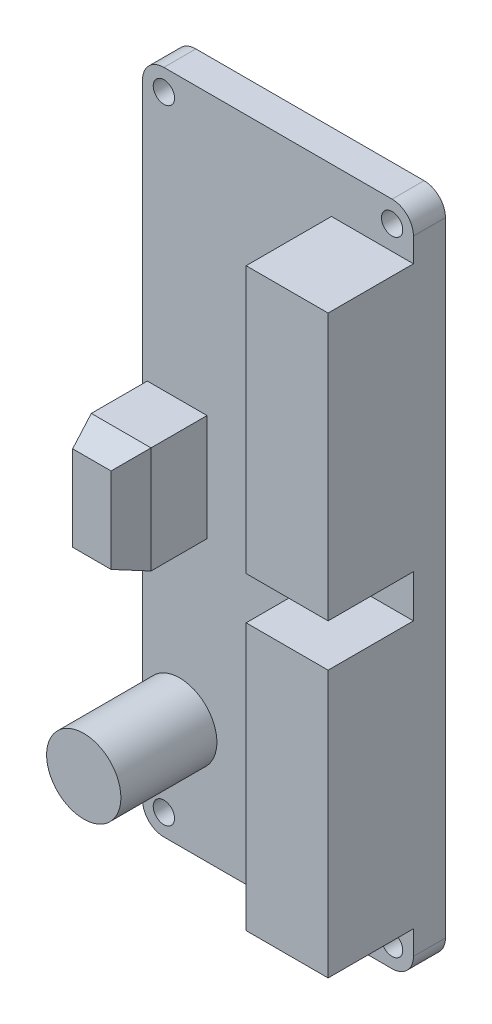
ISO-10303-21;
HEADER;
FILE_DESCRIPTION(('STEP AP214'),'2;1');
FILE_NAME('part.step','',(''),(''),'','','');
FILE_SCHEMA(('AUTOMOTIVE_DESIGN { 1 0 10303 214 1 1 1 1 }'));
ENDSEC;
DATA;
#1=APPLICATION_CONTEXT('core data for automotive mechanical design processes');
#2=APPLICATION_PROTOCOL_DEFINITION('international standard','automotive_design',2000,#1);
#3=PRODUCT_CONTEXT('',#1,'mechanical');
#4=PRODUCT('Part','Part','',(#3));
#5=PRODUCT_RELATED_PRODUCT_CATEGORY('part','',(#4));
#6=PRODUCT_DEFINITION_FORMATION('','',#4);
#7=PRODUCT_DEFINITION_CONTEXT('part definition',#1,'design');
#8=PRODUCT_DEFINITION('design','',#6,#7);
#9=PRODUCT_DEFINITION_SHAPE('','',#8);
#10=(LENGTH_UNIT() NAMED_UNIT(*) SI_UNIT(.MILLI.,.METRE.));
#11=(NAMED_UNIT(*) PLANE_ANGLE_UNIT() SI_UNIT($,.RADIAN.));
#12=(NAMED_UNIT(*) SI_UNIT($,.STERADIAN.) SOLID_ANGLE_UNIT());
#13=UNCERTAINTY_MEASURE_WITH_UNIT(LENGTH_MEASURE(1.E-05),#10,'distance_accuracy_value','');
#14=(GEOMETRIC_REPRESENTATION_CONTEXT(3) GLOBAL_UNCERTAINTY_ASSIGNED_CONTEXT((#13)) GLOBAL_UNIT_ASSIGNED_CONTEXT((#10,
#11,#12)) REPRESENTATION_CONTEXT('',''));
#15=CARTESIAN_POINT('',(0.,0.,0.));
#16=DIRECTION('',(0.,0.,1.));
#17=DIRECTION('',(1.,0.,0.));
#18=AXIS2_PLACEMENT_3D('',#15,#16,#17);
#19=CARTESIAN_POINT('',(-10.7,-29.25,3.));
#20=DIRECTION('',(0.,0.,-1.));
#21=DIRECTION('',(-1.,0.,0.));
#22=AXIS2_PLACEMENT_3D('',#19,#20,#21);
#23=PLANE('',#22);
#24=CARTESIAN_POINT('',(-10.7,29.25,3.));
#25=DIRECTION('',(0.,0.,1.));
#26=DIRECTION('',(1.,0.,0.));
#27=AXIS2_PLACEMENT_3D('',#24,#25,#26);
#28=CIRCLE('',#27,1.);
#29=CARTESIAN_POINT('',(-9.70000000000002,29.25,3.));
#30=VERTEX_POINT('',#29);
#31=EDGE_CURVE('E221',#30,#30,#28,.T.);
#32=ORIENTED_EDGE('',*,*,#31,.F.);
#33=EDGE_LOOP('',(#32));
#34=FACE_BOUND('',#33,.T.);
#35=CARTESIAN_POINT('',(10.7,29.25,3.));
#36=DIRECTION('',(0.,0.,1.));
#37=DIRECTION('',(-1.,0.,0.));
#38=AXIS2_PLACEMENT_3D('',#35,#36,#37);
#39=CIRCLE('',#38,1.);
#40=CARTESIAN_POINT('',(9.70000000000002,29.25,3.));
#41=VERTEX_POINT('',#40);
#42=EDGE_CURVE('E363',#41,#41,#39,.T.);
#43=ORIENTED_EDGE('',*,*,#42,.F.);
#44=EDGE_LOOP('',(#43));
#45=FACE_BOUND('',#44,.T.);
#46=CARTESIAN_POINT('',(10.7,-29.25,3.));
#47=DIRECTION('',(0.,0.,1.));
#48=DIRECTION('',(1.,0.,0.));
#49=AXIS2_PLACEMENT_3D('',#46,#47,#48);
#50=CIRCLE('',#49,1.);
#51=CARTESIAN_POINT('',(11.7,-29.25,3.));
#52=VERTEX_POINT('',#51);
#53=EDGE_CURVE('E372',#52,#52,#50,.T.);
#54=ORIENTED_EDGE('',*,*,#53,.F.);
#55=EDGE_LOOP('',(#54));
#56=FACE_BOUND('',#55,.T.);
#57=CARTESIAN_POINT('',(-10.7,-29.25,3.));
#58=DIRECTION('',(0.,0.,1.));
#59=DIRECTION('',(-1.,0.,0.));
#60=AXIS2_PLACEMENT_3D('',#57,#58,#59);
#61=CIRCLE('',#60,1.);
#62=CARTESIAN_POINT('',(-11.7,-29.25,3.));
#63=VERTEX_POINT('',#62);
#64=EDGE_CURVE('E380',#63,#63,#61,.T.);
#65=ORIENTED_EDGE('',*,*,#64,.F.);
#66=EDGE_LOOP('',(#65));
#67=FACE_BOUND('',#66,.T.);
#68=DIRECTION('',(0.,1.,0.));
#69=VECTOR('',#68,1.);
#70=CARTESIAN_POINT('',(-6.65357981477177,-5.,3.));
#71=LINE('',#70,#69);
#72=CARTESIAN_POINT('',(-6.65357981477177,-5.,3.));
#73=VERTEX_POINT('',#72);
#74=CARTESIAN_POINT('',(-6.65357981477177,5.,3.));
#75=VERTEX_POINT('',#74);
#76=EDGE_CURVE('E519',#73,#75,#71,.T.);
#77=ORIENTED_EDGE('',*,*,#76,.F.);
#78=DIRECTION('',(1.,0.,0.));
#79=VECTOR('',#78,1.);
#80=CARTESIAN_POINT('',(-12.25458743862,-5.,3.));
#81=LINE('',#80,#79);
#82=CARTESIAN_POINT('',(-12.25458743862,-5.,3.));
#83=VERTEX_POINT('',#82);
#84=EDGE_CURVE('E325',#83,#73,#81,.T.);
#85=ORIENTED_EDGE('',*,*,#84,.F.);
#86=DIRECTION('',(0.,-1.,0.));
#87=VECTOR('',#86,1.);
#88=CARTESIAN_POINT('',(-12.25458743862,-5.,3.));
#89=LINE('',#88,#87);
#90=CARTESIAN_POINT('',(-12.25458743862,5.,3.));
#91=VERTEX_POINT('',#90);
#92=EDGE_CURVE('E524',#91,#83,#89,.T.);
#93=ORIENTED_EDGE('',*,*,#92,.F.);
#94=DIRECTION('',(-1.,0.,0.));
#95=VECTOR('',#94,1.);
#96=CARTESIAN_POINT('',(-12.25458743862,5.,3.));
#97=LINE('',#96,#95);
#98=EDGE_CURVE('E354',#75,#91,#97,.T.);
#99=ORIENTED_EDGE('',*,*,#98,.F.);
#100=EDGE_LOOP('',(#77,#85,#93,#99));
#101=FACE_BOUND('',#100,.T.);
#102=DIRECTION('',(0.,-1.,0.));
#103=VECTOR('',#102,1.);
#104=CARTESIAN_POINT('',(-12.7,29.25,3.));
#105=LINE('',#104,#103);
#106=CARTESIAN_POINT('',(-12.7,29.25,3.));
#107=VERTEX_POINT('',#106);
#108=CARTESIAN_POINT('',(-12.7,-21.0736506925286,3.));
#109=VERTEX_POINT('',#108);
#110=EDGE_CURVE('E192',#107,#109,#105,.T.);
#111=ORIENTED_EDGE('',*,*,#110,.T.);
#112=CARTESIAN_POINT('',(-9.21587481036568,-21.0736506925286,3.));
#113=DIRECTION('',(0.,0.,1.));
#114=DIRECTION('',(1.,0.,0.));
#115=AXIS2_PLACEMENT_3D('',#112,#113,#114);
#116=CIRCLE('',#115,3.48412518963434);
#117=EDGE_CURVE('E195',#109,#109,#116,.T.);
#118=ORIENTED_EDGE('',*,*,#117,.F.);
#119=CARTESIAN_POINT('',(-12.7,-29.25,3.));
#120=VERTEX_POINT('',#119);
#121=EDGE_CURVE('E203',#109,#120,#105,.T.);
#122=ORIENTED_EDGE('',*,*,#121,.T.);
#123=CARTESIAN_POINT('',(-10.7,-29.25,3.));
#124=DIRECTION('',(0.,0.,1.));
#125=DIRECTION('',(-1.,0.,0.));
#126=AXIS2_PLACEMENT_3D('',#123,#124,#125);
#127=CIRCLE('',#126,2.);
#128=CARTESIAN_POINT('',(-10.7,-31.25,3.));
#129=VERTEX_POINT('',#128);
#130=EDGE_CURVE('E242',#120,#129,#127,.T.);
#131=ORIENTED_EDGE('',*,*,#130,.T.);
#132=DIRECTION('',(1.,0.,0.));
#133=VECTOR('',#132,1.);
#134=CARTESIAN_POINT('',(-10.7,-31.25,3.));
#135=LINE('',#134,#133);
#136=CARTESIAN_POINT('',(10.7,-31.25,3.));
#137=VERTEX_POINT('',#136);
#138=EDGE_CURVE('E395',#129,#137,#135,.T.);
#139=ORIENTED_EDGE('',*,*,#138,.T.);
#140=CARTESIAN_POINT('',(10.7,-29.25,3.));
#141=DIRECTION('',(0.,0.,1.));
#142=DIRECTION('',(-1.,0.,0.));
#143=AXIS2_PLACEMENT_3D('',#140,#141,#142);
#144=CIRCLE('',#143,2.);
#145=CARTESIAN_POINT('',(12.7,-29.25,3.));
#146=VERTEX_POINT('',#145);
#147=EDGE_CURVE('E398',#137,#146,#144,.T.);
#148=ORIENTED_EDGE('',*,*,#147,.T.);
#149=DIRECTION('',(0.,1.,0.));
#150=VECTOR('',#149,1.);
#151=CARTESIAN_POINT('',(12.7,29.25,3.));
#152=LINE('',#151,#150);
#153=CARTESIAN_POINT('',(12.7,-26.9999597160642,3.));
#154=VERTEX_POINT('',#153);
#155=EDGE_CURVE('E402',#146,#154,#152,.T.);
#156=ORIENTED_EDGE('',*,*,#155,.T.);
#157=DIRECTION('',(1.,0.,0.));
#158=VECTOR('',#157,1.);
#159=CARTESIAN_POINT('',(12.7,-26.9999597160642,3.));
#160=LINE('',#159,#158);
#161=CARTESIAN_POINT('',(5.01188224775228,-26.9999597160642,3.));
#162=VERTEX_POINT('',#161);
#163=EDGE_CURVE('E58',#162,#154,#160,.T.);
#164=ORIENTED_EDGE('',*,*,#163,.F.);
#165=DIRECTION('',(0.,-1.,0.));
#166=VECTOR('',#165,1.);
#167=CARTESIAN_POINT('',(5.01188224775228,-26.9999597160642,3.));
#168=LINE('',#167,#166);
#169=CARTESIAN_POINT('',(5.01188224775228,-1.99995971606418,3.));
#170=VERTEX_POINT('',#169);
#171=EDGE_CURVE('E62',#170,#162,#168,.T.);
#172=ORIENTED_EDGE('',*,*,#171,.F.);
#173=DIRECTION('',(-1.,0.,0.));
#174=VECTOR('',#173,1.);
#175=CARTESIAN_POINT('',(5.01188224775228,-1.99995971606418,3.));
#176=LINE('',#175,#174);
#177=CARTESIAN_POINT('',(12.7,-1.99995971606418,3.));
#178=VERTEX_POINT('',#177);
#179=EDGE_CURVE('E455',#178,#170,#176,.T.);
#180=ORIENTED_EDGE('',*,*,#179,.F.);
#181=CARTESIAN_POINT('',(12.7,1.99995971606418,3.));
#182=VERTEX_POINT('',#181);
#183=EDGE_CURVE('E406',#178,#182,#152,.T.);
#184=ORIENTED_EDGE('',*,*,#183,.T.);
#185=DIRECTION('',(1.,0.,0.));
#186=VECTOR('',#185,1.);
#187=CARTESIAN_POINT('',(5.01188224775228,1.99995971606418,3.));
#188=LINE('',#187,#186);
#189=CARTESIAN_POINT('',(5.01188224775228,1.99995971606418,3.));
#190=VERTEX_POINT('',#189);
#191=EDGE_CURVE('E497',#190,#182,#188,.T.);
#192=ORIENTED_EDGE('',*,*,#191,.F.);
#193=DIRECTION('',(0.,-1.,0.));
#194=VECTOR('',#193,1.);
#195=CARTESIAN_POINT('',(5.01188224775228,26.9999597160642,3.));
#196=LINE('',#195,#194);
#197=CARTESIAN_POINT('',(5.01188224775228,26.9999597160642,3.));
#198=VERTEX_POINT('',#197);
#199=EDGE_CURVE('E447',#198,#190,#196,.T.);
#200=ORIENTED_EDGE('',*,*,#199,.F.);
#201=DIRECTION('',(-1.,0.,0.));
#202=VECTOR('',#201,1.);
#203=CARTESIAN_POINT('',(12.7,26.9999597160642,3.));
#204=LINE('',#203,#202);
#205=CARTESIAN_POINT('',(12.7,26.9999597160642,3.));
#206=VERTEX_POINT('',#205);
#207=EDGE_CURVE('E484',#206,#198,#204,.T.);
#208=ORIENTED_EDGE('',*,*,#207,.F.);
#209=CARTESIAN_POINT('',(12.7,29.25,3.));
#210=VERTEX_POINT('',#209);
#211=EDGE_CURVE('E401',#206,#210,#152,.T.);
#212=ORIENTED_EDGE('',*,*,#211,.T.);
#213=CARTESIAN_POINT('',(10.7,29.25,3.));
#214=DIRECTION('',(0.,0.,1.));
#215=DIRECTION('',(1.,0.,0.));
#216=AXIS2_PLACEMENT_3D('',#213,#214,#215);
#217=CIRCLE('',#216,2.);
#218=CARTESIAN_POINT('',(10.7,31.25,3.));
#219=VERTEX_POINT('',#218);
#220=EDGE_CURVE('E405',#210,#219,#217,.T.);
#221=ORIENTED_EDGE('',*,*,#220,.T.);
#222=DIRECTION('',(-1.,0.,0.));
#223=VECTOR('',#222,1.);
#224=CARTESIAN_POINT('',(-10.7,31.25,3.));
#225=LINE('',#224,#223);
#226=CARTESIAN_POINT('',(-10.7,31.25,3.));
#227=VERTEX_POINT('',#226);
#228=EDGE_CURVE('E212',#219,#227,#225,.T.);
#229=ORIENTED_EDGE('',*,*,#228,.T.);
#230=CARTESIAN_POINT('',(-10.7,29.25,3.));
#231=DIRECTION('',(0.,0.,1.));
#232=DIRECTION('',(1.,0.,0.));
#233=AXIS2_PLACEMENT_3D('',#230,#231,#232);
#234=CIRCLE('',#233,2.);
#235=EDGE_CURVE('E197',#227,#107,#234,.T.);
#236=ORIENTED_EDGE('',*,*,#235,.T.);
#237=EDGE_LOOP('',(#111,#118,#122,#131,#139,#148,#156,#164,#172,#180,#184,#192,#200,#208,#212,
#221,#229,#236));
#238=FACE_BOUND('',#237,.T.);
#239=ADVANCED_FACE('F41',(#34,#45,#56,#67,#101,#238),#23,.F.);
#240=CARTESIAN_POINT('',(-10.7,-29.25,3.));
#241=DIRECTION('',(0.,0.,-1.));
#242=DIRECTION('',(-1.,0.,0.));
#243=AXIS2_PLACEMENT_3D('',#240,#241,#242);
#244=CYLINDRICAL_SURFACE('',#243,2.);
#245=CARTESIAN_POINT('',(-10.7,-29.25,0.));
#246=DIRECTION('',(0.,0.,1.));
#247=DIRECTION('',(-1.,0.,0.));
#248=AXIS2_PLACEMENT_3D('',#245,#246,#247);
#249=CIRCLE('',#248,2.);
#250=CARTESIAN_POINT('',(-12.7,-29.25,0.));
#251=VERTEX_POINT('',#250);
#252=CARTESIAN_POINT('',(-10.7,-31.25,0.));
#253=VERTEX_POINT('',#252);
#254=EDGE_CURVE('E216',#251,#253,#249,.T.);
#255=ORIENTED_EDGE('',*,*,#254,.T.);
#256=DIRECTION('',(0.,0.,-1.));
#257=VECTOR('',#256,1.);
#258=CARTESIAN_POINT('',(-10.7,-31.25,3.));
#259=LINE('',#258,#257);
#260=EDGE_CURVE('E268',#129,#253,#259,.T.);
#261=ORIENTED_EDGE('',*,*,#260,.F.);
#262=ORIENTED_EDGE('',*,*,#130,.F.);
#263=DIRECTION('',(0.,0.,-1.));
#264=VECTOR('',#263,1.);
#265=CARTESIAN_POINT('',(-12.7,-29.25,3.));
#266=LINE('',#265,#264);
#267=EDGE_CURVE('E202',#120,#251,#266,.T.);
#268=ORIENTED_EDGE('',*,*,#267,.T.);
#269=EDGE_LOOP('',(#255,#261,#262,#268));
#270=FACE_BOUND('',#269,.T.);
#271=ADVANCED_FACE('F426',(#270),#244,.T.);
#272=CARTESIAN_POINT('',(-10.7,-31.25,3.));
#273=DIRECTION('',(0.,1.,0.));
#274=DIRECTION('',(0.,0.,1.));
#275=AXIS2_PLACEMENT_3D('',#272,#273,#274);
#276=PLANE('',#275);
#277=DIRECTION('',(1.,0.,0.));
#278=VECTOR('',#277,1.);
#279=CARTESIAN_POINT('',(-10.7,-31.25,0.));
#280=LINE('',#279,#278);
#281=CARTESIAN_POINT('',(10.7,-31.25,0.));
#282=VERTEX_POINT('',#281);
#283=EDGE_CURVE('E220',#253,#282,#280,.T.);
#284=ORIENTED_EDGE('',*,*,#283,.T.);
#285=DIRECTION('',(0.,0.,-1.));
#286=VECTOR('',#285,1.);
#287=CARTESIAN_POINT('',(10.7,-31.25,3.));
#288=LINE('',#287,#286);
#289=EDGE_CURVE('E264',#137,#282,#288,.T.);
#290=ORIENTED_EDGE('',*,*,#289,.F.);
#291=ORIENTED_EDGE('',*,*,#138,.F.);
#292=ORIENTED_EDGE('',*,*,#260,.T.);
#293=EDGE_LOOP('',(#284,#290,#291,#292));
#294=FACE_BOUND('',#293,.T.);
#295=ADVANCED_FACE('F431',(#294),#276,.F.);
#296=CARTESIAN_POINT('',(10.7,-29.25,3.));
#297=DIRECTION('',(0.,0.,-1.));
#298=DIRECTION('',(-1.,0.,0.));
#299=AXIS2_PLACEMENT_3D('',#296,#297,#298);
#300=CYLINDRICAL_SURFACE('',#299,2.);
#301=CARTESIAN_POINT('',(10.7,-29.25,0.));
#302=DIRECTION('',(0.,0.,1.));
#303=DIRECTION('',(-1.,0.,0.));
#304=AXIS2_PLACEMENT_3D('',#301,#302,#303);
#305=CIRCLE('',#304,2.);
#306=CARTESIAN_POINT('',(12.7,-29.25,0.));
#307=VERTEX_POINT('',#306);
#308=EDGE_CURVE('E224',#282,#307,#305,.T.);
#309=ORIENTED_EDGE('',*,*,#308,.T.);
#310=DIRECTION('',(0.,0.,-1.));
#311=VECTOR('',#310,1.);
#312=CARTESIAN_POINT('',(12.7,-29.25,3.));
#313=LINE('',#312,#311);
#314=EDGE_CURVE('E260',#146,#307,#313,.T.);
#315=ORIENTED_EDGE('',*,*,#314,.F.);
#316=ORIENTED_EDGE('',*,*,#147,.F.);
#317=ORIENTED_EDGE('',*,*,#289,.T.);
#318=EDGE_LOOP('',(#309,#315,#316,#317));
#319=FACE_BOUND('',#318,.T.);
#320=ADVANCED_FACE('F433',(#319),#300,.T.);
#321=CARTESIAN_POINT('',(12.7,29.25,3.));
#322=DIRECTION('',(-1.,0.,0.));
#323=DIRECTION('',(0.,-1.,0.));
#324=AXIS2_PLACEMENT_3D('',#321,#322,#323);
#325=PLANE('',#324);
#326=DIRECTION('',(0.,1.,0.));
#327=VECTOR('',#326,1.);
#328=CARTESIAN_POINT('',(12.7,29.25,0.));
#329=LINE('',#328,#327);
#330=CARTESIAN_POINT('',(12.7,29.25,0.));
#331=VERTEX_POINT('',#330);
#332=EDGE_CURVE('E227',#307,#331,#329,.T.);
#333=ORIENTED_EDGE('',*,*,#332,.T.);
#334=DIRECTION('',(0.,0.,-1.));
#335=VECTOR('',#334,1.);
#336=CARTESIAN_POINT('',(12.7,29.25,3.));
#337=LINE('',#336,#335);
#338=EDGE_CURVE('E256',#210,#331,#337,.T.);
#339=ORIENTED_EDGE('',*,*,#338,.F.);
#340=ORIENTED_EDGE('',*,*,#211,.F.);
#341=DIRECTION('',(0.,0.,-1.));
#342=VECTOR('',#341,1.);
#343=CARTESIAN_POINT('',(12.7,26.9999597160642,11.));
#344=LINE('',#343,#342);
#345=CARTESIAN_POINT('',(12.7,26.9999597160642,11.));
#346=VERTEX_POINT('',#345);
#347=EDGE_CURVE('E507',#346,#206,#344,.T.);
#348=ORIENTED_EDGE('',*,*,#347,.F.);
#349=DIRECTION('',(0.,1.,0.));
#350=VECTOR('',#349,1.);
#351=CARTESIAN_POINT('',(12.7,1.99995971606418,11.));
#352=LINE('',#351,#350);
#353=CARTESIAN_POINT('',(12.7,1.99995971606418,11.));
#354=VERTEX_POINT('',#353);
#355=EDGE_CURVE('E487',#354,#346,#352,.T.);
#356=ORIENTED_EDGE('',*,*,#355,.F.);
#357=DIRECTION('',(0.,0.,-1.));
#358=VECTOR('',#357,1.);
#359=CARTESIAN_POINT('',(12.7,1.99995971606418,11.));
#360=LINE('',#359,#358);
#361=EDGE_CURVE('E511',#354,#182,#360,.T.);
#362=ORIENTED_EDGE('',*,*,#361,.T.);
#363=ORIENTED_EDGE('',*,*,#183,.F.);
#364=DIRECTION('',(0.,0.,-1.));
#365=VECTOR('',#364,1.);
#366=CARTESIAN_POINT('',(12.7,-1.99995971606418,11.));
#367=LINE('',#366,#365);
#368=CARTESIAN_POINT('',(12.7,-1.99995971606418,11.));
#369=VERTEX_POINT('',#368);
#370=EDGE_CURVE('E448',#369,#178,#367,.T.);
#371=ORIENTED_EDGE('',*,*,#370,.F.);
#372=DIRECTION('',(0.,1.,0.));
#373=VECTOR('',#372,1.);
#374=CARTESIAN_POINT('',(12.7,-1.99995971606418,11.));
#375=LINE('',#374,#373);
#376=CARTESIAN_POINT('',(12.7,-26.9999597160642,11.));
#377=VERTEX_POINT('',#376);
#378=EDGE_CURVE('E442',#377,#369,#375,.T.);
#379=ORIENTED_EDGE('',*,*,#378,.F.);
#380=DIRECTION('',(0.,0.,-1.));
#381=VECTOR('',#380,1.);
#382=CARTESIAN_POINT('',(12.7,-26.9999597160642,11.));
#383=LINE('',#382,#381);
#384=EDGE_CURVE('E440',#377,#154,#383,.T.);
#385=ORIENTED_EDGE('',*,*,#384,.T.);
#386=ORIENTED_EDGE('',*,*,#155,.F.);
#387=ORIENTED_EDGE('',*,*,#314,.T.);
#388=EDGE_LOOP('',(#333,#339,#340,#348,#356,#362,#363,#371,#379,#385,#386,#387));
#389=FACE_BOUND('',#388,.T.);
#390=ADVANCED_FACE('F438',(#389),#325,.F.);
#391=CARTESIAN_POINT('',(10.7,29.25,3.));
#392=DIRECTION('',(0.,0.,-1.));
#393=DIRECTION('',(-1.,0.,0.));
#394=AXIS2_PLACEMENT_3D('',#391,#392,#393);
#395=CYLINDRICAL_SURFACE('',#394,2.);
#396=CARTESIAN_POINT('',(10.7,29.25,0.));
#397=DIRECTION('',(0.,0.,1.));
#398=DIRECTION('',(1.,0.,0.));
#399=AXIS2_PLACEMENT_3D('',#396,#397,#398);
#400=CIRCLE('',#399,2.);
#401=CARTESIAN_POINT('',(10.7,31.25,0.));
#402=VERTEX_POINT('',#401);
#403=EDGE_CURVE('E230',#331,#402,#400,.T.);
#404=ORIENTED_EDGE('',*,*,#403,.T.);
#405=DIRECTION('',(0.,0.,-1.));
#406=VECTOR('',#405,1.);
#407=CARTESIAN_POINT('',(10.7,31.25,3.));
#408=LINE('',#407,#406);
#409=EDGE_CURVE('E252',#219,#402,#408,.T.);
#410=ORIENTED_EDGE('',*,*,#409,.F.);
#411=ORIENTED_EDGE('',*,*,#220,.F.);
#412=ORIENTED_EDGE('',*,*,#338,.T.);
#413=EDGE_LOOP('',(#404,#410,#411,#412));
#414=FACE_BOUND('',#413,.T.);
#415=ADVANCED_FACE('F576',(#414),#395,.T.);
#416=CARTESIAN_POINT('',(-10.7,31.25,3.));
#417=DIRECTION('',(0.,-1.,0.));
#418=DIRECTION('',(0.,0.,-1.));
#419=AXIS2_PLACEMENT_3D('',#416,#417,#418);
#420=PLANE('',#419);
#421=DIRECTION('',(-1.,0.,0.));
#422=VECTOR('',#421,1.);
#423=CARTESIAN_POINT('',(-10.7,31.25,0.));
#424=LINE('',#423,#422);
#425=CARTESIAN_POINT('',(-10.7,31.25,0.));
#426=VERTEX_POINT('',#425);
#427=EDGE_CURVE('E233',#402,#426,#424,.T.);
#428=ORIENTED_EDGE('',*,*,#427,.T.);
#429=DIRECTION('',(0.,0.,-1.));
#430=VECTOR('',#429,1.);
#431=CARTESIAN_POINT('',(-10.7,31.25,3.));
#432=LINE('',#431,#430);
#433=EDGE_CURVE('E248',#227,#426,#432,.T.);
#434=ORIENTED_EDGE('',*,*,#433,.F.);
#435=ORIENTED_EDGE('',*,*,#228,.F.);
#436=ORIENTED_EDGE('',*,*,#409,.T.);
#437=EDGE_LOOP('',(#428,#434,#435,#436));
#438=FACE_BOUND('',#437,.T.);
#439=ADVANCED_FACE('F414',(#438),#420,.F.);
#440=CARTESIAN_POINT('',(-10.7,29.25,3.));
#441=DIRECTION('',(0.,0.,-1.));
#442=DIRECTION('',(-1.,0.,0.));
#443=AXIS2_PLACEMENT_3D('',#440,#441,#442);
#444=CYLINDRICAL_SURFACE('',#443,2.);
#445=CARTESIAN_POINT('',(-10.7,29.25,0.));
#446=DIRECTION('',(0.,0.,1.));
#447=DIRECTION('',(1.,0.,0.));
#448=AXIS2_PLACEMENT_3D('',#445,#446,#447);
#449=CIRCLE('',#448,2.);
#450=CARTESIAN_POINT('',(-12.7,29.25,0.));
#451=VERTEX_POINT('',#450);
#452=EDGE_CURVE('E236',#426,#451,#449,.T.);
#453=ORIENTED_EDGE('',*,*,#452,.T.);
#454=DIRECTION('',(0.,0.,-1.));
#455=VECTOR('',#454,1.);
#456=CARTESIAN_POINT('',(-12.7,29.25,3.));
#457=LINE('',#456,#455);
#458=EDGE_CURVE('E245',#107,#451,#457,.T.);
#459=ORIENTED_EDGE('',*,*,#458,.F.);
#460=ORIENTED_EDGE('',*,*,#235,.F.);
#461=ORIENTED_EDGE('',*,*,#433,.T.);
#462=EDGE_LOOP('',(#453,#459,#460,#461));
#463=FACE_BOUND('',#462,.T.);
#464=ADVANCED_FACE('F418',(#463),#444,.T.);
#465=CARTESIAN_POINT('',(-12.7,29.25,3.));
#466=DIRECTION('',(1.,0.,0.));
#467=DIRECTION('',(0.,1.,0.));
#468=AXIS2_PLACEMENT_3D('',#465,#466,#467);
#469=PLANE('',#468);
#470=DIRECTION('',(0.,-1.,0.));
#471=VECTOR('',#470,1.);
#472=CARTESIAN_POINT('',(-12.7,29.25,0.));
#473=LINE('',#472,#471);
#474=EDGE_CURVE('E239',#451,#251,#473,.T.);
#475=ORIENTED_EDGE('',*,*,#474,.T.);
#476=ORIENTED_EDGE('',*,*,#267,.F.);
#477=ORIENTED_EDGE('',*,*,#121,.F.);
#478=ORIENTED_EDGE('',*,*,#110,.F.);
#479=ORIENTED_EDGE('',*,*,#458,.T.);
#480=EDGE_LOOP('',(#475,#476,#477,#478,#479));
#481=FACE_BOUND('',#480,.T.);
#482=ADVANCED_FACE('F206',(#481),#469,.F.);
#483=CARTESIAN_POINT('',(-10.7,-29.25,0.));
#484=DIRECTION('',(0.,0.,-1.));
#485=DIRECTION('',(-1.,0.,0.));
#486=AXIS2_PLACEMENT_3D('',#483,#484,#485);
#487=PLANE('',#486);
#488=CARTESIAN_POINT('',(-10.7,-29.25,0.));
#489=DIRECTION('',(0.,0.,-1.));
#490=DIRECTION('',(-1.,0.,0.));
#491=AXIS2_PLACEMENT_3D('',#488,#489,#490);
#492=CIRCLE('',#491,1.);
#493=CARTESIAN_POINT('',(-11.7,-29.25,0.));
#494=VERTEX_POINT('',#493);
#495=EDGE_CURVE('E359',#494,#494,#492,.F.);
#496=ORIENTED_EDGE('',*,*,#495,.T.);
#497=EDGE_LOOP('',(#496));
#498=FACE_BOUND('',#497,.T.);
#499=CARTESIAN_POINT('',(10.7,-29.25,0.));
#500=DIRECTION('',(0.,0.,-1.));
#501=DIRECTION('',(-1.,0.,0.));
#502=AXIS2_PLACEMENT_3D('',#499,#500,#501);
#503=CIRCLE('',#502,1.);
#504=CARTESIAN_POINT('',(9.70000000000002,-29.25,0.));
#505=VERTEX_POINT('',#504);
#506=EDGE_CURVE('E376',#505,#505,#503,.F.);
#507=ORIENTED_EDGE('',*,*,#506,.T.);
#508=EDGE_LOOP('',(#507));
#509=FACE_BOUND('',#508,.T.);
#510=CARTESIAN_POINT('',(10.7,29.25,0.));
#511=DIRECTION('',(0.,0.,-1.));
#512=DIRECTION('',(-1.,0.,0.));
#513=AXIS2_PLACEMENT_3D('',#510,#511,#512);
#514=CIRCLE('',#513,1.);
#515=CARTESIAN_POINT('',(9.70000000000002,29.25,0.));
#516=VERTEX_POINT('',#515);
#517=EDGE_CURVE('E368',#516,#516,#514,.F.);
#518=ORIENTED_EDGE('',*,*,#517,.T.);
#519=EDGE_LOOP('',(#518));
#520=FACE_BOUND('',#519,.T.);
#521=CARTESIAN_POINT('',(-10.7,29.25,0.));
#522=DIRECTION('',(0.,0.,-1.));
#523=DIRECTION('',(-1.,0.,0.));
#524=AXIS2_PLACEMENT_3D('',#521,#522,#523);
#525=CIRCLE('',#524,1.);
#526=CARTESIAN_POINT('',(-11.7,29.25,0.));
#527=VERTEX_POINT('',#526);
#528=EDGE_CURVE('E367',#527,#527,#525,.F.);
#529=ORIENTED_EDGE('',*,*,#528,.T.);
#530=EDGE_LOOP('',(#529));
#531=FACE_BOUND('',#530,.T.);
#532=ORIENTED_EDGE('',*,*,#254,.F.);
#533=ORIENTED_EDGE('',*,*,#474,.F.);
#534=ORIENTED_EDGE('',*,*,#452,.F.);
#535=ORIENTED_EDGE('',*,*,#427,.F.);
#536=ORIENTED_EDGE('',*,*,#403,.F.);
#537=ORIENTED_EDGE('',*,*,#332,.F.);
#538=ORIENTED_EDGE('',*,*,#308,.F.);
#539=ORIENTED_EDGE('',*,*,#283,.F.);
#540=EDGE_LOOP('',(#532,#533,#534,#535,#536,#537,#538,#539));
#541=FACE_BOUND('',#540,.T.);
#542=ADVANCED_FACE('F422',(#498,#509,#520,#531,#541),#487,.T.);
#543=CARTESIAN_POINT('',(-10.7,29.25,-0.00100000000000013));
#544=DIRECTION('',(0.,0.,1.));
#545=DIRECTION('',(1.,0.,0.));
#546=AXIS2_PLACEMENT_3D('',#543,#544,#545);
#547=CYLINDRICAL_SURFACE('',#546,1.);
#548=ORIENTED_EDGE('',*,*,#528,.F.);
#549=EDGE_LOOP('',(#548));
#550=FACE_BOUND('',#549,.T.);
#551=ORIENTED_EDGE('',*,*,#31,.T.);
#552=EDGE_LOOP('',(#551));
#553=FACE_BOUND('',#552,.T.);
#554=ADVANCED_FACE('F565',(#550,#553),#547,.F.);
#555=CARTESIAN_POINT('',(10.7,29.25,-0.00100000000000013));
#556=DIRECTION('',(0.,0.,1.));
#557=DIRECTION('',(1.,0.,0.));
#558=AXIS2_PLACEMENT_3D('',#555,#556,#557);
#559=CYLINDRICAL_SURFACE('',#558,1.);
#560=ORIENTED_EDGE('',*,*,#517,.F.);
#561=EDGE_LOOP('',(#560));
#562=FACE_BOUND('',#561,.T.);
#563=ORIENTED_EDGE('',*,*,#42,.T.);
#564=EDGE_LOOP('',(#563));
#565=FACE_BOUND('',#564,.T.);
#566=ADVANCED_FACE('F628',(#562,#565),#559,.F.);
#567=CARTESIAN_POINT('',(10.7,-29.25,-0.00100000000000013));
#568=DIRECTION('',(0.,0.,1.));
#569=DIRECTION('',(1.,0.,0.));
#570=AXIS2_PLACEMENT_3D('',#567,#568,#569);
#571=CYLINDRICAL_SURFACE('',#570,1.);
#572=ORIENTED_EDGE('',*,*,#506,.F.);
#573=EDGE_LOOP('',(#572));
#574=FACE_BOUND('',#573,.T.);
#575=ORIENTED_EDGE('',*,*,#53,.T.);
#576=EDGE_LOOP('',(#575));
#577=FACE_BOUND('',#576,.T.);
#578=ADVANCED_FACE('F631',(#574,#577),#571,.F.);
#579=CARTESIAN_POINT('',(-10.7,-29.25,-0.00100000000000013));
#580=DIRECTION('',(0.,0.,1.));
#581=DIRECTION('',(1.,0.,0.));
#582=AXIS2_PLACEMENT_3D('',#579,#580,#581);
#583=CYLINDRICAL_SURFACE('',#582,1.);
#584=ORIENTED_EDGE('',*,*,#495,.F.);
#585=EDGE_LOOP('',(#584));
#586=FACE_BOUND('',#585,.T.);
#587=ORIENTED_EDGE('',*,*,#64,.T.);
#588=EDGE_LOOP('',(#587));
#589=FACE_BOUND('',#588,.T.);
#590=ADVANCED_FACE('F627',(#586,#589),#583,.F.);
#591=CARTESIAN_POINT('',(-6.65357981477177,-5.,11.));
#592=DIRECTION('',(-1.,0.,0.));
#593=DIRECTION('',(0.,0.,1.));
#594=AXIS2_PLACEMENT_3D('',#591,#592,#593);
#595=PLANE('',#594);
#596=DIRECTION('',(0.,0.,-1.));
#597=VECTOR('',#596,1.);
#598=CARTESIAN_POINT('',(-6.65357981477177,5.,11.));
#599=LINE('',#598,#597);
#600=CARTESIAN_POINT('',(-6.65357981477177,5.,8.25252258054538));
#601=VERTEX_POINT('',#600);
#602=EDGE_CURVE('E316',#601,#75,#599,.T.);
#603=ORIENTED_EDGE('',*,*,#602,.F.);
#604=DIRECTION('',(0.,-1.,0.));
#605=VECTOR('',#604,1.);
#606=CARTESIAN_POINT('',(-6.65357981477177,-5.,8.25252258054538));
#607=LINE('',#606,#605);
#608=CARTESIAN_POINT('',(-6.65357981477177,-5.,8.25252258054538));
#609=VERTEX_POINT('',#608);
#610=EDGE_CURVE('E51',#601,#609,#607,.T.);
#611=ORIENTED_EDGE('',*,*,#610,.T.);
#612=DIRECTION('',(0.,0.,-1.));
#613=VECTOR('',#612,1.);
#614=CARTESIAN_POINT('',(-6.65357981477177,-5.,11.));
#615=LINE('',#614,#613);
#616=EDGE_CURVE('E314',#609,#73,#615,.T.);
#617=ORIENTED_EDGE('',*,*,#616,.T.);
#618=ORIENTED_EDGE('',*,*,#76,.T.);
#619=EDGE_LOOP('',(#603,#611,#617,#618));
#620=FACE_BOUND('',#619,.T.);
#621=ADVANCED_FACE('F312',(#620),#595,.F.);
#622=CARTESIAN_POINT('',(-12.25458743862,5.,11.));
#623=DIRECTION('',(0.,-1.,0.));
#624=DIRECTION('',(0.,0.,-1.));
#625=AXIS2_PLACEMENT_3D('',#622,#623,#624);
#626=PLANE('',#625);
#627=DIRECTION('',(0.,0.,-1.));
#628=VECTOR('',#627,1.);
#629=CARTESIAN_POINT('',(-12.25458743862,5.,11.));
#630=LINE('',#629,#628);
#631=CARTESIAN_POINT('',(-12.25458743862,5.,8.25252258054538));
#632=VERTEX_POINT('',#631);
#633=EDGE_CURVE('E348',#632,#91,#630,.T.);
#634=ORIENTED_EDGE('',*,*,#633,.F.);
#635=DIRECTION('',(1.,0.,0.));
#636=VECTOR('',#635,1.);
#637=CARTESIAN_POINT('',(-12.25458743862,5.,8.25252258054538));
#638=LINE('',#637,#636);
#639=EDGE_CURVE('E283',#632,#601,#638,.T.);
#640=ORIENTED_EDGE('',*,*,#639,.T.);
#641=ORIENTED_EDGE('',*,*,#602,.T.);
#642=ORIENTED_EDGE('',*,*,#98,.T.);
#643=EDGE_LOOP('',(#634,#640,#641,#642));
#644=FACE_BOUND('',#643,.T.);
#645=ADVANCED_FACE('F352',(#644),#626,.F.);
#646=CARTESIAN_POINT('',(-12.25458743862,-5.,11.));
#647=DIRECTION('',(1.,0.,0.));
#648=DIRECTION('',(0.,0.,-1.));
#649=AXIS2_PLACEMENT_3D('',#646,#647,#648);
#650=PLANE('',#649);
#651=DIRECTION('',(0.,0.,-1.));
#652=VECTOR('',#651,1.);
#653=CARTESIAN_POINT('',(-12.25458743862,-5.,11.));
#654=LINE('',#653,#652);
#655=CARTESIAN_POINT('',(-12.25458743862,-5.,8.25252258054538));
#656=VERTEX_POINT('',#655);
#657=EDGE_CURVE('E327',#656,#83,#654,.T.);
#658=ORIENTED_EDGE('',*,*,#657,.F.);
#659=DIRECTION('',(0.,1.,0.));
#660=VECTOR('',#659,1.);
#661=CARTESIAN_POINT('',(-12.25458743862,-5.,8.25252258054538));
#662=LINE('',#661,#660);
#663=EDGE_CURVE('E294',#656,#632,#662,.T.);
#664=ORIENTED_EDGE('',*,*,#663,.T.);
#665=ORIENTED_EDGE('',*,*,#633,.T.);
#666=ORIENTED_EDGE('',*,*,#92,.T.);
#667=EDGE_LOOP('',(#658,#664,#665,#666));
#668=FACE_BOUND('',#667,.T.);
#669=ADVANCED_FACE('F346',(#668),#650,.F.);
#670=CARTESIAN_POINT('',(-12.25458743862,-5.,11.));
#671=DIRECTION('',(0.,1.,0.));
#672=DIRECTION('',(0.,0.,1.));
#673=AXIS2_PLACEMENT_3D('',#670,#671,#672);
#674=PLANE('',#673);
#675=ORIENTED_EDGE('',*,*,#616,.F.);
#676=DIRECTION('',(-1.,0.,0.));
#677=VECTOR('',#676,1.);
#678=CARTESIAN_POINT('',(-12.25458743862,-5.,8.25252258054538));
#679=LINE('',#678,#677);
#680=EDGE_CURVE('E276',#609,#656,#679,.T.);
#681=ORIENTED_EDGE('',*,*,#680,.T.);
#682=ORIENTED_EDGE('',*,*,#657,.T.);
#683=ORIENTED_EDGE('',*,*,#84,.T.);
#684=EDGE_LOOP('',(#675,#681,#682,#683));
#685=FACE_BOUND('',#684,.T.);
#686=ADVANCED_FACE('F322',(#685),#674,.F.);
#687=CARTESIAN_POINT('',(0.,0.,11.));
#688=DIRECTION('',(0.,0.,-1.));
#689=DIRECTION('',(-1.,0.,0.));
#690=AXIS2_PLACEMENT_3D('',#687,#688,#689);
#691=PLANE('',#690);
#692=DIRECTION('',(1.,0.,0.));
#693=VECTOR('',#692,1.);
#694=CARTESIAN_POINT('',(0.,-4.,11.));
#695=LINE('',#694,#693);
#696=CARTESIAN_POINT('',(-11.25458743862,-4.,11.));
#697=VERTEX_POINT('',#696);
#698=CARTESIAN_POINT('',(-7.65357981477177,-4.,11.));
#699=VERTEX_POINT('',#698);
#700=EDGE_CURVE('E272',#697,#699,#695,.T.);
#701=ORIENTED_EDGE('',*,*,#700,.T.);
#702=DIRECTION('',(0.,1.,0.));
#703=VECTOR('',#702,1.);
#704=CARTESIAN_POINT('',(-7.65357981477177,0.,11.));
#705=LINE('',#704,#703);
#706=CARTESIAN_POINT('',(-7.65357981477177,4.,11.));
#707=VERTEX_POINT('',#706);
#708=EDGE_CURVE('E301',#699,#707,#705,.T.);
#709=ORIENTED_EDGE('',*,*,#708,.T.);
#710=DIRECTION('',(-1.,0.,0.));
#711=VECTOR('',#710,1.);
#712=CARTESIAN_POINT('',(0.,4.,11.));
#713=LINE('',#712,#711);
#714=CARTESIAN_POINT('',(-11.25458743862,4.,11.));
#715=VERTEX_POINT('',#714);
#716=EDGE_CURVE('E280',#707,#715,#713,.T.);
#717=ORIENTED_EDGE('',*,*,#716,.T.);
#718=DIRECTION('',(0.,-1.,0.));
#719=VECTOR('',#718,1.);
#720=CARTESIAN_POINT('',(-11.25458743862,0.,11.));
#721=LINE('',#720,#719);
#722=EDGE_CURVE('E287',#715,#697,#721,.T.);
#723=ORIENTED_EDGE('',*,*,#722,.T.);
#724=EDGE_LOOP('',(#701,#709,#717,#723));
#725=FACE_BOUND('',#724,.T.);
#726=ADVANCED_FACE('F335',(#725),#691,.F.);
#727=CARTESIAN_POINT('',(0.,-4.,11.));
#728=DIRECTION('',(0.,0.939692620785908,-0.342020143325669));
#729=DIRECTION('',(1.,0.,0.));
#730=AXIS2_PLACEMENT_3D('',#727,#728,#729);
#731=PLANE('',#730);
#732=ORIENTED_EDGE('',*,*,#680,.F.);
#733=DIRECTION('',(-0.323615577118185,0.323615577118185,0.889126490715988));
#734=VECTOR('',#733,1.);
#735=CARTESIAN_POINT('',(-6.85204304194614,-4.80153677282562,8.79779581579908));
#736=LINE('',#735,#734);
#737=EDGE_CURVE('E11',#609,#699,#736,.T.);
#738=ORIENTED_EDGE('',*,*,#737,.T.);
#739=ORIENTED_EDGE('',*,*,#700,.F.);
#740=DIRECTION('',(-0.323615577118185,-0.323615577118185,-0.889126490715988));
#741=VECTOR('',#740,1.);
#742=CARTESIAN_POINT('',(-10.0759277900168,-2.82134035139683,14.2383407697595));
#743=LINE('',#742,#741);
#744=EDGE_CURVE('E291',#697,#656,#743,.T.);
#745=ORIENTED_EDGE('',*,*,#744,.T.);
#746=EDGE_LOOP('',(#732,#738,#739,#745));
#747=FACE_BOUND('',#746,.T.);
#748=ADVANCED_FACE('F330',(#747),#731,.F.);
#749=CARTESIAN_POINT('',(0.,4.,11.));
#750=DIRECTION('',(0.,-0.939692620785908,-0.342020143325669));
#751=DIRECTION('',(-1.,0.,0.));
#752=AXIS2_PLACEMENT_3D('',#749,#750,#751);
#753=PLANE('',#752);
#754=ORIENTED_EDGE('',*,*,#716,.F.);
#755=DIRECTION('',(0.323615577118185,0.323615577118185,-0.889126490715988));
#756=VECTOR('',#755,1.);
#757=CARTESIAN_POINT('',(-6.85204304194614,4.80153677282562,8.79779581579908));
#758=LINE('',#757,#756);
#759=EDGE_CURVE('E305',#707,#601,#758,.T.);
#760=ORIENTED_EDGE('',*,*,#759,.T.);
#761=ORIENTED_EDGE('',*,*,#639,.F.);
#762=DIRECTION('',(0.323615577118185,-0.323615577118185,0.889126490715988));
#763=VECTOR('',#762,1.);
#764=CARTESIAN_POINT('',(-10.0759277900168,2.82134035139682,14.2383407697595));
#765=LINE('',#764,#763);
#766=EDGE_CURVE('E297',#632,#715,#765,.T.);
#767=ORIENTED_EDGE('',*,*,#766,.T.);
#768=EDGE_LOOP('',(#754,#760,#761,#767));
#769=FACE_BOUND('',#768,.T.);
#770=ADVANCED_FACE('F337',(#769),#753,.F.);
#771=CARTESIAN_POINT('',(-11.25458743862,0.,11.));
#772=DIRECTION('',(0.939692620785908,0.,-0.342020143325669));
#773=DIRECTION('',(0.,-1.,0.));
#774=AXIS2_PLACEMENT_3D('',#771,#772,#773);
#775=PLANE('',#774);
#776=ORIENTED_EDGE('',*,*,#766,.F.);
#777=ORIENTED_EDGE('',*,*,#663,.F.);
#778=ORIENTED_EDGE('',*,*,#744,.F.);
#779=ORIENTED_EDGE('',*,*,#722,.F.);
#780=EDGE_LOOP('',(#776,#777,#778,#779));
#781=FACE_BOUND('',#780,.T.);
#782=ADVANCED_FACE('F343',(#781),#775,.F.);
#783=CARTESIAN_POINT('',(-7.65357981477177,0.,11.));
#784=DIRECTION('',(-0.939692620785908,0.,-0.342020143325669));
#785=DIRECTION('',(0.,1.,0.));
#786=AXIS2_PLACEMENT_3D('',#783,#784,#785);
#787=PLANE('',#786);
#788=ORIENTED_EDGE('',*,*,#737,.F.);
#789=ORIENTED_EDGE('',*,*,#610,.F.);
#790=ORIENTED_EDGE('',*,*,#759,.F.);
#791=ORIENTED_EDGE('',*,*,#708,.F.);
#792=EDGE_LOOP('',(#788,#789,#790,#791));
#793=FACE_BOUND('',#792,.T.);
#794=ADVANCED_FACE('F44',(#793),#787,.F.);
#795=CARTESIAN_POINT('',(5.01188224775228,26.9999597160642,11.));
#796=DIRECTION('',(1.,0.,0.));
#797=DIRECTION('',(0.,0.,-1.));
#798=AXIS2_PLACEMENT_3D('',#795,#796,#797);
#799=PLANE('',#798);
#800=ORIENTED_EDGE('',*,*,#199,.T.);
#801=DIRECTION('',(0.,0.,-1.));
#802=VECTOR('',#801,1.);
#803=CARTESIAN_POINT('',(5.01188224775228,1.99995971606418,11.));
#804=LINE('',#803,#802);
#805=CARTESIAN_POINT('',(5.01188224775228,1.99995971606418,11.));
#806=VERTEX_POINT('',#805);
#807=EDGE_CURVE('E515',#806,#190,#804,.T.);
#808=ORIENTED_EDGE('',*,*,#807,.F.);
#809=DIRECTION('',(0.,-1.,0.));
#810=VECTOR('',#809,1.);
#811=CARTESIAN_POINT('',(5.01188224775228,26.9999597160642,11.));
#812=LINE('',#811,#810);
#813=CARTESIAN_POINT('',(5.01188224775228,26.9999597160642,11.));
#814=VERTEX_POINT('',#813);
#815=EDGE_CURVE('E479',#814,#806,#812,.T.);
#816=ORIENTED_EDGE('',*,*,#815,.F.);
#817=DIRECTION('',(0.,0.,-1.));
#818=VECTOR('',#817,1.);
#819=CARTESIAN_POINT('',(5.01188224775228,26.9999597160642,11.));
#820=LINE('',#819,#818);
#821=EDGE_CURVE('E493',#814,#198,#820,.T.);
#822=ORIENTED_EDGE('',*,*,#821,.T.);
#823=EDGE_LOOP('',(#800,#808,#816,#822));
#824=FACE_BOUND('',#823,.T.);
#825=ADVANCED_FACE('F602',(#824),#799,.F.);
#826=CARTESIAN_POINT('',(5.01188224775228,1.99995971606418,11.));
#827=DIRECTION('',(0.,1.,0.));
#828=DIRECTION('',(0.,0.,1.));
#829=AXIS2_PLACEMENT_3D('',#826,#827,#828);
#830=PLANE('',#829);
#831=ORIENTED_EDGE('',*,*,#191,.T.);
#832=ORIENTED_EDGE('',*,*,#361,.F.);
#833=DIRECTION('',(1.,0.,0.));
#834=VECTOR('',#833,1.);
#835=CARTESIAN_POINT('',(5.01188224775228,1.99995971606418,11.));
#836=LINE('',#835,#834);
#837=EDGE_CURVE('E483',#806,#354,#836,.T.);
#838=ORIENTED_EDGE('',*,*,#837,.F.);
#839=ORIENTED_EDGE('',*,*,#807,.T.);
#840=EDGE_LOOP('',(#831,#832,#838,#839));
#841=FACE_BOUND('',#840,.T.);
#842=ADVANCED_FACE('F606',(#841),#830,.F.);
#843=CARTESIAN_POINT('',(12.7,26.9999597160642,11.));
#844=DIRECTION('',(0.,-1.,0.));
#845=DIRECTION('',(0.,0.,-1.));
#846=AXIS2_PLACEMENT_3D('',#843,#844,#845);
#847=PLANE('',#846);
#848=ORIENTED_EDGE('',*,*,#207,.T.);
#849=ORIENTED_EDGE('',*,*,#821,.F.);
#850=DIRECTION('',(-1.,0.,0.));
#851=VECTOR('',#850,1.);
#852=CARTESIAN_POINT('',(12.7,26.9999597160642,11.));
#853=LINE('',#852,#851);
#854=EDGE_CURVE('E490',#346,#814,#853,.T.);
#855=ORIENTED_EDGE('',*,*,#854,.F.);
#856=ORIENTED_EDGE('',*,*,#347,.T.);
#857=EDGE_LOOP('',(#848,#849,#855,#856));
#858=FACE_BOUND('',#857,.T.);
#859=ADVANCED_FACE('F612',(#858),#847,.F.);
#860=CARTESIAN_POINT('',(0.,0.,11.));
#861=DIRECTION('',(0.,0.,1.));
#862=DIRECTION('',(1.,0.,0.));
#863=AXIS2_PLACEMENT_3D('',#860,#861,#862);
#864=PLANE('',#863);
#865=ORIENTED_EDGE('',*,*,#815,.T.);
#866=ORIENTED_EDGE('',*,*,#837,.T.);
#867=ORIENTED_EDGE('',*,*,#355,.T.);
#868=ORIENTED_EDGE('',*,*,#854,.T.);
#869=EDGE_LOOP('',(#865,#866,#867,#868));
#870=FACE_BOUND('',#869,.T.);
#871=ADVANCED_FACE('F746',(#870),#864,.T.);
#872=CARTESIAN_POINT('',(12.7,-26.9999597160642,11.));
#873=DIRECTION('',(0.,1.,0.));
#874=DIRECTION('',(0.,0.,1.));
#875=AXIS2_PLACEMENT_3D('',#872,#873,#874);
#876=PLANE('',#875);
#877=ORIENTED_EDGE('',*,*,#163,.T.);
#878=ORIENTED_EDGE('',*,*,#384,.F.);
#879=DIRECTION('',(1.,0.,0.));
#880=VECTOR('',#879,1.);
#881=CARTESIAN_POINT('',(12.7,-26.9999597160642,11.));
#882=LINE('',#881,#880);
#883=CARTESIAN_POINT('',(5.01188224775228,-26.9999597160642,11.));
#884=VERTEX_POINT('',#883);
#885=EDGE_CURVE('E469',#884,#377,#882,.T.);
#886=ORIENTED_EDGE('',*,*,#885,.F.);
#887=DIRECTION('',(0.,0.,-1.));
#888=VECTOR('',#887,1.);
#889=CARTESIAN_POINT('',(5.01188224775228,-26.9999597160642,11.));
#890=LINE('',#889,#888);
#891=EDGE_CURVE('E453',#884,#162,#890,.T.);
#892=ORIENTED_EDGE('',*,*,#891,.T.);
#893=EDGE_LOOP('',(#877,#878,#886,#892));
#894=FACE_BOUND('',#893,.T.);
#895=ADVANCED_FACE('F451',(#894),#876,.F.);
#896=CARTESIAN_POINT('',(5.01188224775228,-1.99995971606418,11.));
#897=DIRECTION('',(0.,-1.,0.));
#898=DIRECTION('',(0.,0.,-1.));
#899=AXIS2_PLACEMENT_3D('',#896,#897,#898);
#900=PLANE('',#899);
#901=ORIENTED_EDGE('',*,*,#179,.T.);
#902=DIRECTION('',(0.,0.,-1.));
#903=VECTOR('',#902,1.);
#904=CARTESIAN_POINT('',(5.01188224775228,-1.99995971606418,11.));
#905=LINE('',#904,#903);
#906=CARTESIAN_POINT('',(5.01188224775228,-1.99995971606418,11.));
#907=VERTEX_POINT('',#906);
#908=EDGE_CURVE('E472',#907,#170,#905,.T.);
#909=ORIENTED_EDGE('',*,*,#908,.F.);
#910=DIRECTION('',(-1.,0.,0.));
#911=VECTOR('',#910,1.);
#912=CARTESIAN_POINT('',(5.01188224775228,-1.99995971606418,11.));
#913=LINE('',#912,#911);
#914=EDGE_CURVE('E530',#369,#907,#913,.T.);
#915=ORIENTED_EDGE('',*,*,#914,.F.);
#916=ORIENTED_EDGE('',*,*,#370,.T.);
#917=EDGE_LOOP('',(#901,#909,#915,#916));
#918=FACE_BOUND('',#917,.T.);
#919=ADVANCED_FACE('F764',(#918),#900,.F.);
#920=CARTESIAN_POINT('',(5.01188224775228,-26.9999597160642,11.));
#921=DIRECTION('',(1.,0.,0.));
#922=DIRECTION('',(0.,0.,-1.));
#923=AXIS2_PLACEMENT_3D('',#920,#921,#922);
#924=PLANE('',#923);
#925=ORIENTED_EDGE('',*,*,#171,.T.);
#926=ORIENTED_EDGE('',*,*,#891,.F.);
#927=DIRECTION('',(0.,-1.,0.));
#928=VECTOR('',#927,1.);
#929=CARTESIAN_POINT('',(5.01188224775228,-26.9999597160642,11.));
#930=LINE('',#929,#928);
#931=EDGE_CURVE('E464',#907,#884,#930,.T.);
#932=ORIENTED_EDGE('',*,*,#931,.F.);
#933=ORIENTED_EDGE('',*,*,#908,.T.);
#934=EDGE_LOOP('',(#925,#926,#932,#933));
#935=FACE_BOUND('',#934,.T.);
#936=ADVANCED_FACE('F551',(#935),#924,.F.);
#937=CARTESIAN_POINT('',(0.,0.,11.));
#938=DIRECTION('',(0.,0.,-1.));
#939=DIRECTION('',(-1.,0.,0.));
#940=AXIS2_PLACEMENT_3D('',#937,#938,#939);
#941=PLANE('',#940);
#942=ORIENTED_EDGE('',*,*,#885,.T.);
#943=ORIENTED_EDGE('',*,*,#378,.T.);
#944=ORIENTED_EDGE('',*,*,#914,.T.);
#945=ORIENTED_EDGE('',*,*,#931,.T.);
#946=EDGE_LOOP('',(#942,#943,#944,#945));
#947=FACE_BOUND('',#946,.T.);
#948=ADVANCED_FACE('F542',(#947),#941,.F.);
#949=CARTESIAN_POINT('',(-9.21587481036568,-21.0736506925286,12.));
#950=DIRECTION('',(0.,0.,-1.));
#951=DIRECTION('',(-1.,0.,0.));
#952=AXIS2_PLACEMENT_3D('',#949,#950,#951);
#953=CYLINDRICAL_SURFACE('',#952,3.48412518963434);
#954=CARTESIAN_POINT('',(-9.21587481036568,-21.0736506925286,12.));
#955=DIRECTION('',(0.,0.,1.));
#956=DIRECTION('',(1.,0.,0.));
#957=AXIS2_PLACEMENT_3D('',#954,#955,#956);
#958=CIRCLE('',#957,3.48412518963434);
#959=CARTESIAN_POINT('',(-5.73174962073134,-21.0736506925286,12.));
#960=VERTEX_POINT('',#959);
#961=EDGE_CURVE('E456',#960,#960,#958,.T.);
#962=ORIENTED_EDGE('',*,*,#961,.F.);
#963=EDGE_LOOP('',(#962));
#964=FACE_BOUND('',#963,.T.);
#965=ORIENTED_EDGE('',*,*,#117,.T.);
#966=EDGE_LOOP('',(#965));
#967=FACE_BOUND('',#966,.T.);
#968=ADVANCED_FACE('F539',(#964,#967),#953,.T.);
#969=CARTESIAN_POINT('',(-9.21587481036568,-21.0736506925286,12.));
#970=DIRECTION('',(0.,0.,1.));
#971=DIRECTION('',(1.,0.,0.));
#972=AXIS2_PLACEMENT_3D('',#969,#970,#971);
#973=PLANE('',#972);
#974=ORIENTED_EDGE('',*,*,#961,.T.);
#975=EDGE_LOOP('',(#974));
#976=FACE_BOUND('',#975,.T.);
#977=ADVANCED_FACE('F541',(#976),#973,.T.);
#978=CLOSED_SHELL('',(#239,#271,#295,#320,#390,#415,#439,#464,#482,#542,#554,#566,#578,#590,
#621,#645,#669,#686,#726,#748,#770,#782,#794,#825,#842,#859,#871,#895,#919,#936,#948,#968,#977));
#979=MANIFOLD_SOLID_BREP('B2',#978);
#980=ADVANCED_BREP_SHAPE_REPRESENTATION('',(#18,#979),#14);
#981=SHAPE_DEFINITION_REPRESENTATION(#9,#980);
ENDSEC;
END-ISO-10303-21;
